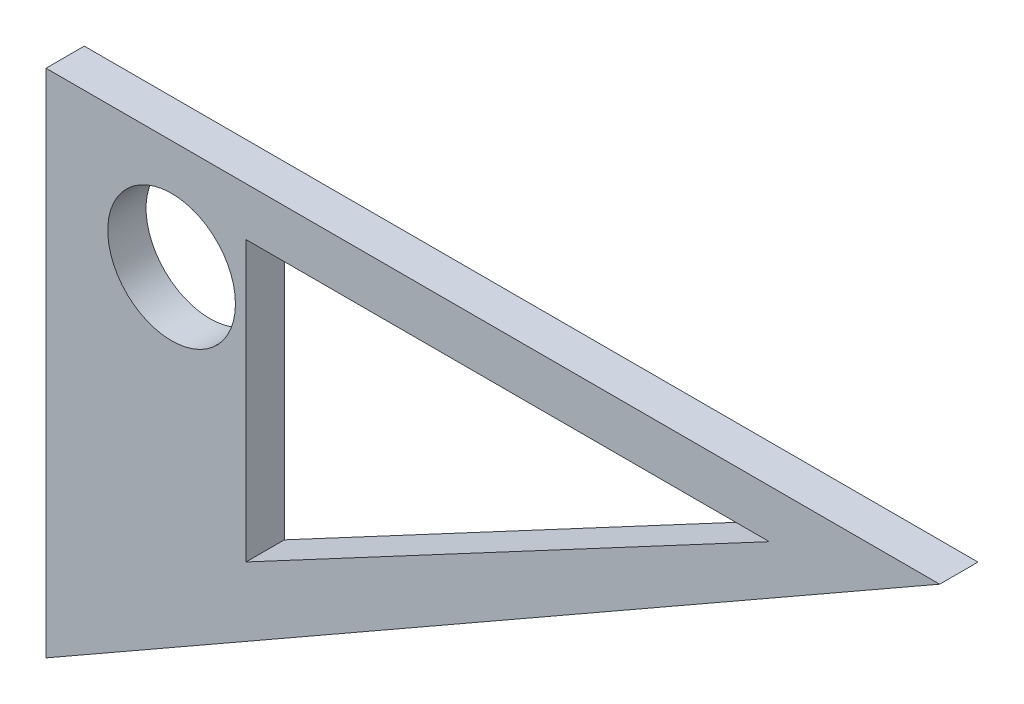
ISO-10303-21;
HEADER;
FILE_DESCRIPTION(('STEP AP214'),'2;1');
FILE_NAME('part.step','',(''),(''),'','','');
FILE_SCHEMA(('AUTOMOTIVE_DESIGN { 1 0 10303 214 1 1 1 1 }'));
ENDSEC;
DATA;
#1=APPLICATION_CONTEXT('core data for automotive mechanical design processes');
#2=APPLICATION_PROTOCOL_DEFINITION('international standard','automotive_design',2000,#1);
#3=PRODUCT_CONTEXT('',#1,'mechanical');
#4=PRODUCT('Part','Part','',(#3));
#5=PRODUCT_RELATED_PRODUCT_CATEGORY('part','',(#4));
#6=PRODUCT_DEFINITION_FORMATION('','',#4);
#7=PRODUCT_DEFINITION_CONTEXT('part definition',#1,'design');
#8=PRODUCT_DEFINITION('design','',#6,#7);
#9=PRODUCT_DEFINITION_SHAPE('','',#8);
#10=(LENGTH_UNIT() NAMED_UNIT(*) SI_UNIT(.MILLI.,.METRE.));
#11=(NAMED_UNIT(*) PLANE_ANGLE_UNIT() SI_UNIT($,.RADIAN.));
#12=(NAMED_UNIT(*) SI_UNIT($,.STERADIAN.) SOLID_ANGLE_UNIT());
#13=UNCERTAINTY_MEASURE_WITH_UNIT(LENGTH_MEASURE(1.E-05),#10,'distance_accuracy_value','');
#14=(GEOMETRIC_REPRESENTATION_CONTEXT(3) GLOBAL_UNCERTAINTY_ASSIGNED_CONTEXT((#13)) GLOBAL_UNIT_ASSIGNED_CONTEXT((#10,
#11,#12)) REPRESENTATION_CONTEXT('',''));
#15=CARTESIAN_POINT('',(0.,0.,0.));
#16=DIRECTION('',(0.,0.,1.));
#17=DIRECTION('',(1.,0.,0.));
#18=AXIS2_PLACEMENT_3D('',#15,#16,#17);
#19=CARTESIAN_POINT('',(-9.83796380346897,-31.4294823071359,3.));
#20=DIRECTION('',(0.,0.,1.));
#21=DIRECTION('',(1.,0.,0.));
#22=AXIS2_PLACEMENT_3D('',#19,#20,#21);
#23=PLANE('',#22);
#24=CARTESIAN_POINT('',(0.,0.,3.));
#25=DIRECTION('',(0.,0.,1.));
#26=DIRECTION('',(1.,0.,0.));
#27=AXIS2_PLACEMENT_3D('',#24,#25,#26);
#28=CIRCLE('',#27,5.);
#29=CARTESIAN_POINT('',(5.,0.,3.));
#30=VERTEX_POINT('',#29);
#31=EDGE_CURVE('E111',#30,#30,#28,.T.);
#32=ORIENTED_EDGE('',*,*,#31,.F.);
#33=EDGE_LOOP('',(#32));
#34=FACE_BOUND('',#33,.T.);
#35=DIRECTION('',(0.868243142124459,0.496138938356834,0.));
#36=VECTOR('',#35,1.);
#37=CARTESIAN_POINT('',(-9.83796380346897,-31.4294823071359,3.));
#38=LINE('',#37,#36);
#39=CARTESIAN_POINT('',(-9.83796380346897,-31.4294823071359,3.));
#40=VERTEX_POINT('',#39);
#41=CARTESIAN_POINT('',(60.162036196531,8.57051769286413,3.));
#42=VERTEX_POINT('',#41);
#43=EDGE_CURVE('E117',#40,#42,#38,.T.);
#44=ORIENTED_EDGE('',*,*,#43,.T.);
#45=DIRECTION('',(-1.,0.,0.));
#46=VECTOR('',#45,1.);
#47=CARTESIAN_POINT('',(-9.83796380346897,8.57051769286413,3.));
#48=LINE('',#47,#46);
#49=CARTESIAN_POINT('',(-9.83796380346897,8.57051769286413,3.));
#50=VERTEX_POINT('',#49);
#51=EDGE_CURVE('E120',#42,#50,#48,.T.);
#52=ORIENTED_EDGE('',*,*,#51,.T.);
#53=DIRECTION('',(0.,-1.,0.));
#54=VECTOR('',#53,1.);
#55=CARTESIAN_POINT('',(-9.83796380346897,-31.4294823071359,3.));
#56=LINE('',#55,#54);
#57=EDGE_CURVE('E123',#50,#40,#56,.T.);
#58=ORIENTED_EDGE('',*,*,#57,.T.);
#59=EDGE_LOOP('',(#44,#52,#58));
#60=FACE_BOUND('',#59,.T.);
#61=DIRECTION('',(0.,-1.,0.));
#62=VECTOR('',#61,1.);
#63=CARTESIAN_POINT('',(5.83188227194698,4.78220325704928,3.));
#64=LINE('',#63,#62);
#65=CARTESIAN_POINT('',(5.83188227194698,4.78220325704928,3.));
#66=VERTEX_POINT('',#65);
#67=CARTESIAN_POINT('',(5.83188227194697,-17.0867028042455,3.));
#68=VERTEX_POINT('',#67);
#69=EDGE_CURVE('E92',#66,#68,#64,.T.);
#70=ORIENTED_EDGE('',*,*,#69,.F.);
#71=DIRECTION('',(-1.,0.,0.));
#72=VECTOR('',#71,1.);
#73=CARTESIAN_POINT('',(46.8145566230349,4.78220325704928,3.));
#74=LINE('',#73,#72);
#75=CARTESIAN_POINT('',(46.8145566230349,4.78220325704928,3.));
#76=VERTEX_POINT('',#75);
#77=EDGE_CURVE('E84',#76,#66,#74,.T.);
#78=ORIENTED_EDGE('',*,*,#77,.F.);
#79=DIRECTION('',(0.882250306107823,0.470780625528124,0.));
#80=VECTOR('',#79,1.);
#81=CARTESIAN_POINT('',(5.83188227194698,-17.0867028042455,3.));
#82=LINE('',#81,#80);
#83=EDGE_CURVE('E101',#68,#76,#82,.T.);
#84=ORIENTED_EDGE('',*,*,#83,.F.);
#85=EDGE_LOOP('',(#70,#78,#84));
#86=FACE_BOUND('',#85,.T.);
#87=ADVANCED_FACE('F31',(#34,#60,#86),#23,.T.);
#88=CARTESIAN_POINT('',(-9.83796380346897,-31.4294823071359,0.));
#89=DIRECTION('',(0.,0.,1.));
#90=DIRECTION('',(1.,0.,0.));
#91=AXIS2_PLACEMENT_3D('',#88,#89,#90);
#92=PLANE('',#91);
#93=CARTESIAN_POINT('',(0.,0.,0.));
#94=DIRECTION('',(0.,0.,1.));
#95=DIRECTION('',(1.,0.,0.));
#96=AXIS2_PLACEMENT_3D('',#93,#94,#95);
#97=CIRCLE('',#96,5.);
#98=CARTESIAN_POINT('',(5.,0.,0.));
#99=VERTEX_POINT('',#98);
#100=EDGE_CURVE('E99',#99,#99,#97,.T.);
#101=ORIENTED_EDGE('',*,*,#100,.T.);
#102=EDGE_LOOP('',(#101));
#103=FACE_BOUND('',#102,.T.);
#104=DIRECTION('',(0.868243142124459,0.496138938356834,0.));
#105=VECTOR('',#104,1.);
#106=CARTESIAN_POINT('',(-9.83796380346897,-31.4294823071359,0.));
#107=LINE('',#106,#105);
#108=CARTESIAN_POINT('',(-9.83796380346897,-31.4294823071359,0.));
#109=VERTEX_POINT('',#108);
#110=CARTESIAN_POINT('',(60.162036196531,8.57051769286413,0.));
#111=VERTEX_POINT('',#110);
#112=EDGE_CURVE('E114',#109,#111,#107,.T.);
#113=ORIENTED_EDGE('',*,*,#112,.F.);
#114=DIRECTION('',(0.,-1.,0.));
#115=VECTOR('',#114,1.);
#116=CARTESIAN_POINT('',(-9.83796380346897,-31.4294823071359,0.));
#117=LINE('',#116,#115);
#118=CARTESIAN_POINT('',(-9.83796380346897,8.57051769286413,0.));
#119=VERTEX_POINT('',#118);
#120=EDGE_CURVE('E121',#119,#109,#117,.T.);
#121=ORIENTED_EDGE('',*,*,#120,.F.);
#122=DIRECTION('',(-1.,0.,0.));
#123=VECTOR('',#122,1.);
#124=CARTESIAN_POINT('',(-9.83796380346897,8.57051769286413,0.));
#125=LINE('',#124,#123);
#126=EDGE_CURVE('E128',#111,#119,#125,.T.);
#127=ORIENTED_EDGE('',*,*,#126,.F.);
#128=EDGE_LOOP('',(#113,#121,#127));
#129=FACE_BOUND('',#128,.T.);
#130=DIRECTION('',(-1.,0.,0.));
#131=VECTOR('',#130,1.);
#132=CARTESIAN_POINT('',(46.8145566230349,4.78220325704928,0.));
#133=LINE('',#132,#131);
#134=CARTESIAN_POINT('',(46.8145566230349,4.78220325704928,0.));
#135=VERTEX_POINT('',#134);
#136=CARTESIAN_POINT('',(5.83188227194698,4.78220325704928,0.));
#137=VERTEX_POINT('',#136);
#138=EDGE_CURVE('E54',#135,#137,#133,.T.);
#139=ORIENTED_EDGE('',*,*,#138,.T.);
#140=DIRECTION('',(0.,-1.,0.));
#141=VECTOR('',#140,1.);
#142=CARTESIAN_POINT('',(5.83188227194698,4.78220325704928,0.));
#143=LINE('',#142,#141);
#144=CARTESIAN_POINT('',(5.83188227194698,-17.0867028042455,0.));
#145=VERTEX_POINT('',#144);
#146=EDGE_CURVE('E98',#137,#145,#143,.T.);
#147=ORIENTED_EDGE('',*,*,#146,.T.);
#148=DIRECTION('',(0.882250306107823,0.470780625528124,0.));
#149=VECTOR('',#148,1.);
#150=CARTESIAN_POINT('',(5.83188227194698,-17.0867028042455,0.));
#151=LINE('',#150,#149);
#152=EDGE_CURVE('E93',#145,#135,#151,.T.);
#153=ORIENTED_EDGE('',*,*,#152,.T.);
#154=EDGE_LOOP('',(#139,#147,#153));
#155=FACE_BOUND('',#154,.T.);
#156=ADVANCED_FACE('F142',(#103,#129,#155),#92,.F.);
#157=CARTESIAN_POINT('',(-9.83796380346897,-31.4294823071359,3.));
#158=DIRECTION('',(-0.496138938356834,0.868243142124459,0.));
#159=DIRECTION('',(-0.868243142124459,-0.496138938356834,0.));
#160=AXIS2_PLACEMENT_3D('',#157,#158,#159);
#161=PLANE('',#160);
#162=ORIENTED_EDGE('',*,*,#112,.T.);
#163=DIRECTION('',(0.,0.,-1.));
#164=VECTOR('',#163,1.);
#165=CARTESIAN_POINT('',(60.162036196531,8.57051769286413,3.));
#166=LINE('',#165,#164);
#167=EDGE_CURVE('E11',#42,#111,#166,.T.);
#168=ORIENTED_EDGE('',*,*,#167,.F.);
#169=ORIENTED_EDGE('',*,*,#43,.F.);
#170=DIRECTION('',(0.,0.,-1.));
#171=VECTOR('',#170,1.);
#172=CARTESIAN_POINT('',(-9.83796380346897,-31.4294823071359,3.));
#173=LINE('',#172,#171);
#174=EDGE_CURVE('E125',#40,#109,#173,.T.);
#175=ORIENTED_EDGE('',*,*,#174,.T.);
#176=EDGE_LOOP('',(#162,#168,#169,#175));
#177=FACE_BOUND('',#176,.T.);
#178=ADVANCED_FACE('F33',(#177),#161,.F.);
#179=CARTESIAN_POINT('',(-9.83796380346897,8.57051769286413,3.));
#180=DIRECTION('',(0.,-1.,0.));
#181=DIRECTION('',(0.,0.,-1.));
#182=AXIS2_PLACEMENT_3D('',#179,#180,#181);
#183=PLANE('',#182);
#184=ORIENTED_EDGE('',*,*,#126,.T.);
#185=DIRECTION('',(0.,0.,-1.));
#186=VECTOR('',#185,1.);
#187=CARTESIAN_POINT('',(-9.83796380346897,8.57051769286413,3.));
#188=LINE('',#187,#186);
#189=EDGE_CURVE('E39',#50,#119,#188,.T.);
#190=ORIENTED_EDGE('',*,*,#189,.F.);
#191=ORIENTED_EDGE('',*,*,#51,.F.);
#192=ORIENTED_EDGE('',*,*,#167,.T.);
#193=EDGE_LOOP('',(#184,#190,#191,#192));
#194=FACE_BOUND('',#193,.T.);
#195=ADVANCED_FACE('F148',(#194),#183,.F.);
#196=CARTESIAN_POINT('',(-9.83796380346897,-31.4294823071359,3.));
#197=DIRECTION('',(1.,0.,0.));
#198=DIRECTION('',(0.,0.,-1.));
#199=AXIS2_PLACEMENT_3D('',#196,#197,#198);
#200=PLANE('',#199);
#201=ORIENTED_EDGE('',*,*,#120,.T.);
#202=ORIENTED_EDGE('',*,*,#174,.F.);
#203=ORIENTED_EDGE('',*,*,#57,.F.);
#204=ORIENTED_EDGE('',*,*,#189,.T.);
#205=EDGE_LOOP('',(#201,#202,#203,#204));
#206=FACE_BOUND('',#205,.T.);
#207=ADVANCED_FACE('F137',(#206),#200,.F.);
#208=CARTESIAN_POINT('',(0.,0.,3.));
#209=DIRECTION('',(0.,0.,-1.));
#210=DIRECTION('',(-1.,0.,0.));
#211=AXIS2_PLACEMENT_3D('',#208,#209,#210);
#212=CYLINDRICAL_SURFACE('',#211,5.);
#213=ORIENTED_EDGE('',*,*,#31,.T.);
#214=EDGE_LOOP('',(#213));
#215=FACE_BOUND('',#214,.T.);
#216=ORIENTED_EDGE('',*,*,#100,.F.);
#217=EDGE_LOOP('',(#216));
#218=FACE_BOUND('',#217,.T.);
#219=ADVANCED_FACE('F154',(#215,#218),#212,.F.);
#220=CARTESIAN_POINT('',(46.8145566230349,4.78220325704928,3.));
#221=DIRECTION('',(0.,-1.,0.));
#222=DIRECTION('',(0.,0.,-1.));
#223=AXIS2_PLACEMENT_3D('',#220,#221,#222);
#224=PLANE('',#223);
#225=ORIENTED_EDGE('',*,*,#138,.F.);
#226=DIRECTION('',(0.,0.,-1.));
#227=VECTOR('',#226,1.);
#228=CARTESIAN_POINT('',(46.8145566230349,4.78220325704928,3.));
#229=LINE('',#228,#227);
#230=EDGE_CURVE('E88',#76,#135,#229,.T.);
#231=ORIENTED_EDGE('',*,*,#230,.F.);
#232=ORIENTED_EDGE('',*,*,#77,.T.);
#233=DIRECTION('',(0.,0.,-1.));
#234=VECTOR('',#233,1.);
#235=CARTESIAN_POINT('',(5.83188227194698,4.78220325704928,3.));
#236=LINE('',#235,#234);
#237=EDGE_CURVE('E87',#66,#137,#236,.T.);
#238=ORIENTED_EDGE('',*,*,#237,.T.);
#239=EDGE_LOOP('',(#225,#231,#232,#238));
#240=FACE_BOUND('',#239,.T.);
#241=ADVANCED_FACE('F86',(#240),#224,.T.);
#242=CARTESIAN_POINT('',(5.83188227194698,4.78220325704928,3.));
#243=DIRECTION('',(1.,0.,0.));
#244=DIRECTION('',(0.,0.,-1.));
#245=AXIS2_PLACEMENT_3D('',#242,#243,#244);
#246=PLANE('',#245);
#247=ORIENTED_EDGE('',*,*,#146,.F.);
#248=ORIENTED_EDGE('',*,*,#237,.F.);
#249=ORIENTED_EDGE('',*,*,#69,.T.);
#250=DIRECTION('',(0.,0.,-1.));
#251=VECTOR('',#250,1.);
#252=CARTESIAN_POINT('',(5.83188227194698,-17.0867028042455,3.));
#253=LINE('',#252,#251);
#254=EDGE_CURVE('E46',#68,#145,#253,.T.);
#255=ORIENTED_EDGE('',*,*,#254,.T.);
#256=EDGE_LOOP('',(#247,#248,#249,#255));
#257=FACE_BOUND('',#256,.T.);
#258=ADVANCED_FACE('F96',(#257),#246,.T.);
#259=CARTESIAN_POINT('',(5.83188227194698,-17.0867028042455,3.));
#260=DIRECTION('',(-0.470780625528124,0.882250306107823,0.));
#261=DIRECTION('',(-0.882250306107824,-0.470780625528124,0.));
#262=AXIS2_PLACEMENT_3D('',#259,#260,#261);
#263=PLANE('',#262);
#264=ORIENTED_EDGE('',*,*,#152,.F.);
#265=ORIENTED_EDGE('',*,*,#254,.F.);
#266=ORIENTED_EDGE('',*,*,#83,.T.);
#267=ORIENTED_EDGE('',*,*,#230,.T.);
#268=EDGE_LOOP('',(#264,#265,#266,#267));
#269=FACE_BOUND('',#268,.T.);
#270=ADVANCED_FACE('F173',(#269),#263,.T.);
#271=CLOSED_SHELL('',(#87,#156,#178,#195,#207,#219,#241,#258,#270));
#272=MANIFOLD_SOLID_BREP('B2',#271);
#273=ADVANCED_BREP_SHAPE_REPRESENTATION('',(#18,#272),#14);
#274=SHAPE_DEFINITION_REPRESENTATION(#9,#273);
ENDSEC;
END-ISO-10303-21;
